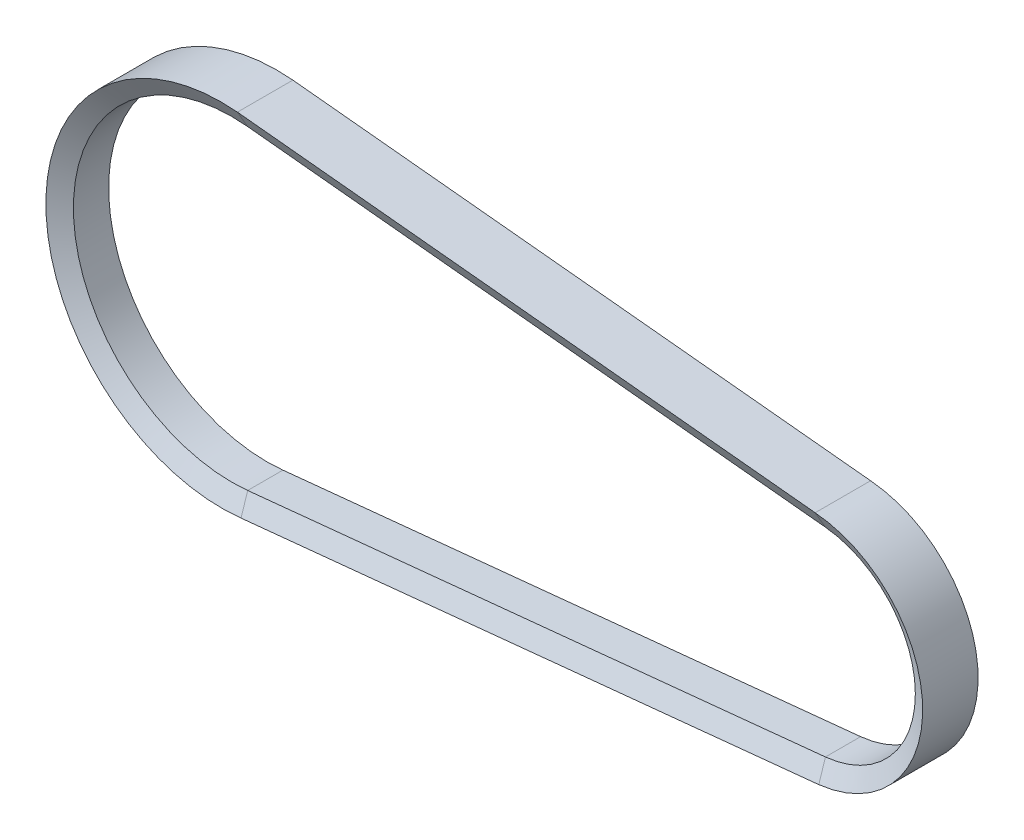
ISO-10303-21;
HEADER;
FILE_DESCRIPTION(('STEP AP214'),'2;1');
FILE_NAME('part.step','',(''),(''),'','','');
FILE_SCHEMA(('AUTOMOTIVE_DESIGN { 1 0 10303 214 1 1 1 1 }'));
ENDSEC;
DATA;
#1=APPLICATION_CONTEXT('core data for automotive mechanical design processes');
#2=APPLICATION_PROTOCOL_DEFINITION('international standard','automotive_design',2000,#1);
#3=PRODUCT_CONTEXT('',#1,'mechanical');
#4=PRODUCT('Part','Part','',(#3));
#5=PRODUCT_RELATED_PRODUCT_CATEGORY('part','',(#4));
#6=PRODUCT_DEFINITION_FORMATION('','',#4);
#7=PRODUCT_DEFINITION_CONTEXT('part definition',#1,'design');
#8=PRODUCT_DEFINITION('design','',#6,#7);
#9=PRODUCT_DEFINITION_SHAPE('','',#8);
#10=(LENGTH_UNIT() NAMED_UNIT(*) SI_UNIT(.MILLI.,.METRE.));
#11=(NAMED_UNIT(*) PLANE_ANGLE_UNIT() SI_UNIT($,.RADIAN.));
#12=(NAMED_UNIT(*) SI_UNIT($,.STERADIAN.) SOLID_ANGLE_UNIT());
#13=UNCERTAINTY_MEASURE_WITH_UNIT(LENGTH_MEASURE(1.E-05),#10,'distance_accuracy_value','');
#14=(GEOMETRIC_REPRESENTATION_CONTEXT(3) GLOBAL_UNCERTAINTY_ASSIGNED_CONTEXT((#13)) GLOBAL_UNIT_ASSIGNED_CONTEXT((#10,
#11,#12)) REPRESENTATION_CONTEXT('',''));
#15=CARTESIAN_POINT('',(0.,0.,0.));
#16=DIRECTION('',(0.,0.,1.));
#17=DIRECTION('',(1.,0.,0.));
#18=AXIS2_PLACEMENT_3D('',#15,#16,#17);
#19=CARTESIAN_POINT('',(0.,0.,0.));
#20=DIRECTION('',(0.,0.,-1.));
#21=DIRECTION('',(-1.,0.,0.));
#22=AXIS2_PLACEMENT_3D('',#19,#20,#21);
#23=CYLINDRICAL_SURFACE('',#22,54.2693283540528);
#24=CARTESIAN_POINT('',(0.,0.,5.57937029150209));
#25=DIRECTION('',(0.,0.,-1.));
#26=DIRECTION('',(0.100496256101983,-0.994937436480046,0.));
#27=AXIS2_PLACEMENT_3D('',#24,#25,#26);
#28=CIRCLE('',#27,54.2693283540528);
#29=CARTESIAN_POINT('',(5.45386432075151,-53.9945864320752,5.57937029150209));
#30=VERTEX_POINT('',#29);
#31=CARTESIAN_POINT('',(5.40000000000001,54.,5.57937029150209));
#32=VERTEX_POINT('',#31);
#33=EDGE_CURVE('E11',#30,#32,#28,.T.);
#34=ORIENTED_EDGE('',*,*,#33,.F.);
#35=DIRECTION('',(0.,0.,-1.));
#36=VECTOR('',#35,1.);
#37=CARTESIAN_POINT('',(5.4538643207515,-53.9945864320752,5.57937029150209));
#38=LINE('',#37,#36);
#39=CARTESIAN_POINT('',(5.45386432075151,-53.9945864320752,-6.49062970849791));
#40=VERTEX_POINT('',#39);
#41=EDGE_CURVE('E42',#30,#40,#38,.T.);
#42=ORIENTED_EDGE('',*,*,#41,.T.);
#43=CARTESIAN_POINT('',(0.,0.,-6.49062970849791));
#44=DIRECTION('',(0.,0.,-1.));
#45=DIRECTION('',(0.100496256101983,-0.994937436480046,0.));
#46=AXIS2_PLACEMENT_3D('',#43,#44,#45);
#47=CIRCLE('',#46,54.2693283540528);
#48=CARTESIAN_POINT('',(5.40000000000001,54.,-6.49062970849791));
#49=VERTEX_POINT('',#48);
#50=EDGE_CURVE('E125',#40,#49,#47,.T.);
#51=ORIENTED_EDGE('',*,*,#50,.T.);
#52=DIRECTION('',(0.,0.,-1.));
#53=VECTOR('',#52,1.);
#54=CARTESIAN_POINT('',(5.40000000000001,54.,5.57937029150209));
#55=LINE('',#54,#53);
#56=EDGE_CURVE('E128',#32,#49,#55,.T.);
#57=ORIENTED_EDGE('',*,*,#56,.F.);
#58=EDGE_LOOP('',(#34,#42,#51,#57));
#59=FACE_BOUND('',#58,.T.);
#60=ADVANCED_FACE('F39',(#59),#23,.F.);
#61=CARTESIAN_POINT('',(6.64784924527945,-59.8745864320751,9.04347190663988));
#62=CARTESIAN_POINT('',(-31.2778496811351,-64.0854602603342,9.04347190663988));
#63=CARTESIAN_POINT('',(-59.8420495606798,-38.7837491977207,9.04347190663988));
#64=CARTESIAN_POINT('',(-60.2392462263972,-0.627067839624251,9.04347190663988));
#65=CARTESIAN_POINT('',(-60.6364428921146,37.5296135184722,9.04347190663988));
#66=CARTESIAN_POINT('',(-32.605138259558,63.4204624433602,9.04347190663988));
#67=CARTESIAN_POINT('',(5.40000000000001,60.,9.04347190663988));
#68=CARTESIAN_POINT('',(5.4538643207515,-53.9945864320752,5.57937029150209));
#69=CARTESIAN_POINT('',(-28.7473310562264,-57.449167558059,5.57937029150209));
#70=CARTESIAN_POINT('',(-54.2521763206357,-34.4022856863446,5.57937029150209));
#71=CARTESIAN_POINT('',(-54.2693216037575,-0.027067839624249,5.57937029150209));
#72=CARTESIAN_POINT('',(-54.2864668868793,34.3481500070961,5.57937029150209));
#73=CARTESIAN_POINT('',(-28.8046244336022,57.4204624433602,5.57937029150209));
#74=CARTESIAN_POINT('',(5.40000000000001,54.,5.57937029150209));
#75=(BOUNDED_SURFACE() B_SPLINE_SURFACE(1,3,((#61,#62,#63,#64,#65,#66,#67),(#68,#69,#70,#71,#72,
#73,#74)),.UNSPECIFIED.,.F.,.F.,.F.) B_SPLINE_SURFACE_WITH_KNOTS((2,2),(4,3,4),(0.,1.),(0.,0.5,
1.),.UNSPECIFIED.) GEOMETRIC_REPRESENTATION_ITEM() RATIONAL_B_SPLINE_SURFACE(((1.,
0.780546928833291,0.780546928833291,1.,0.780546928833291,0.780546928833291,1.),(1.,
0.780546928833291,0.780546928833291,1.,0.780546928833291,0.780546928833291,1.))) REPRESENTATION_ITEM('') SURFACE());
#76=CARTESIAN_POINT('',(0.,0.,9.04347190663988));
#77=DIRECTION('',(0.,0.,-1.));
#78=DIRECTION('',(0.110351465359693,-0.993892627044274,0.));
#79=AXIS2_PLACEMENT_3D('',#76,#77,#78);
#80=CIRCLE('',#79,60.2425099078715);
#81=CARTESIAN_POINT('',(6.64784924527945,-59.8745864320752,9.04347190663988));
#82=VERTEX_POINT('',#81);
#83=CARTESIAN_POINT('',(5.40000000000001,60.,9.04347190663988));
#84=VERTEX_POINT('',#83);
#85=EDGE_CURVE('E48',#82,#84,#80,.T.);
#86=DIRECTION('',(-0.172336879396141,0.848704895708748,-0.500000000000004));
#87=VECTOR('',#86,1.);
#88=CARTESIAN_POINT('',(5.4538643207515,-53.9945864320752,5.57937029150209));
#89=LINE('',#88,#87);
#90=EDGE_CURVE('E213',#82,#30,#89,.T.);
#91=DIRECTION('',(0.,-0.866025403784436,-0.500000000000004));
#92=VECTOR('',#91,1.);
#93=CARTESIAN_POINT('',(5.40000000000001,54.,5.57937029150209));
#94=LINE('',#93,#92);
#95=EDGE_CURVE('E156',#84,#32,#94,.T.);
#96=ORIENTED_EDGE('',*,*,#85,.F.);
#97=ORIENTED_EDGE('',*,*,#90,.T.);
#98=ORIENTED_EDGE('',*,*,#33,.T.);
#99=ORIENTED_EDGE('',*,*,#95,.F.);
#100=EDGE_LOOP('',(#96,#97,#98,#99));
#101=FACE_BOUND('',#100,.T.);
#102=ADVANCED_FACE('F264',(#101),#75,.T.);
#103=CARTESIAN_POINT('',(0.,0.,0.));
#104=DIRECTION('',(0.,0.,-1.));
#105=DIRECTION('',(-1.,0.,0.));
#106=AXIS2_PLACEMENT_3D('',#103,#104,#105);
#107=CYLINDRICAL_SURFACE('',#106,60.2425099078715);
#108=CARTESIAN_POINT('',(0.,0.,-9.9547313236357));
#109=DIRECTION('',(0.,0.,-1.));
#110=DIRECTION('',(0.110351465359693,-0.993892627044274,0.));
#111=AXIS2_PLACEMENT_3D('',#108,#109,#110);
#112=CIRCLE('',#111,60.2425099078715);
#113=CARTESIAN_POINT('',(6.64784924527945,-59.8745864320752,-9.9547313236357));
#114=VERTEX_POINT('',#113);
#115=CARTESIAN_POINT('',(5.40000000000001,60.,-9.9547313236357));
#116=VERTEX_POINT('',#115);
#117=EDGE_CURVE('E135',#114,#116,#112,.T.);
#118=ORIENTED_EDGE('',*,*,#117,.F.);
#119=DIRECTION('',(0.,0.,1.));
#120=VECTOR('',#119,1.);
#121=CARTESIAN_POINT('',(6.64784924527945,-59.8745864320752,9.04347190663988));
#122=LINE('',#121,#120);
#123=EDGE_CURVE('E189',#114,#82,#122,.T.);
#124=ORIENTED_EDGE('',*,*,#123,.T.);
#125=ORIENTED_EDGE('',*,*,#85,.T.);
#126=DIRECTION('',(0.,0.,1.));
#127=VECTOR('',#126,1.);
#128=CARTESIAN_POINT('',(5.40000000000001,60.,9.04347190663988));
#129=LINE('',#128,#127);
#130=EDGE_CURVE('E162',#116,#84,#129,.T.);
#131=ORIENTED_EDGE('',*,*,#130,.F.);
#132=EDGE_LOOP('',(#118,#124,#125,#131));
#133=FACE_BOUND('',#132,.T.);
#134=ADVANCED_FACE('F260',(#133),#107,.T.);
#135=CARTESIAN_POINT('',(203.453864320752,-34.0948376899427,5.57937029150209));
#136=DIRECTION('',(-0.1,0.99498743710662,0.));
#137=DIRECTION('',(-0.99498743710662,-0.1,0.));
#138=AXIS2_PLACEMENT_3D('',#135,#136,#137);
#139=PLANE('',#138);
#140=ORIENTED_EDGE('',*,*,#41,.F.);
#141=DIRECTION('',(-0.99498743710662,-0.1,0.));
#142=VECTOR('',#141,1.);
#143=CARTESIAN_POINT('',(203.453864320752,-34.0948376899427,5.57937029150209));
#144=LINE('',#143,#142);
#145=CARTESIAN_POINT('',(203.453864320752,-34.0948376899427,5.57937029150209));
#146=VERTEX_POINT('',#145);
#147=EDGE_CURVE('E56',#146,#30,#144,.T.);
#148=ORIENTED_EDGE('',*,*,#147,.F.);
#149=DIRECTION('',(0.,0.,-1.));
#150=VECTOR('',#149,1.);
#151=CARTESIAN_POINT('',(203.453864320752,-34.0948376899427,5.57937029150209));
#152=LINE('',#151,#150);
#153=CARTESIAN_POINT('',(203.453864320752,-34.0948376899427,-6.49062970849791));
#154=VERTEX_POINT('',#153);
#155=EDGE_CURVE('E195',#146,#154,#152,.T.);
#156=ORIENTED_EDGE('',*,*,#155,.T.);
#157=DIRECTION('',(-0.99498743710662,-0.1,0.));
#158=VECTOR('',#157,1.);
#159=CARTESIAN_POINT('',(203.453864320752,-34.0948376899427,-6.49062970849791));
#160=LINE('',#159,#158);
#161=EDGE_CURVE('E192',#154,#40,#160,.T.);
#162=ORIENTED_EDGE('',*,*,#161,.T.);
#163=EDGE_LOOP('',(#140,#148,#156,#162));
#164=FACE_BOUND('',#163,.T.);
#165=ADVANCED_FACE('F239',(#164),#139,.T.);
#166=CARTESIAN_POINT('',(203.453864320752,-34.0948376899427,5.57937029150209));
#167=DIRECTION('',(-0.0501885613228501,0.499369880026909,0.864934003976172));
#168=DIRECTION('',(0.,-0.866025403784436,0.500000000000004));
#169=AXIS2_PLACEMENT_3D('',#166,#167,#168);
#170=PLANE('',#169);
#171=ORIENTED_EDGE('',*,*,#147,.T.);
#172=ORIENTED_EDGE('',*,*,#90,.F.);
#173=DIRECTION('',(-0.99498743710662,-0.1,0.));
#174=VECTOR('',#173,1.);
#175=CARTESIAN_POINT('',(204.647849245279,-39.9748376899427,9.04347190663988));
#176=LINE('',#175,#174);
#177=CARTESIAN_POINT('',(204.647849245279,-39.9748376899427,9.04347190663988));
#178=VERTEX_POINT('',#177);
#179=EDGE_CURVE('E65',#178,#82,#176,.T.);
#180=ORIENTED_EDGE('',*,*,#179,.F.);
#181=DIRECTION('',(-0.172336879396141,0.848704895708748,-0.500000000000004));
#182=VECTOR('',#181,1.);
#183=CARTESIAN_POINT('',(203.453864320752,-34.0948376899427,5.57937029150209));
#184=LINE('',#183,#182);
#185=EDGE_CURVE('E209',#178,#146,#184,.T.);
#186=ORIENTED_EDGE('',*,*,#185,.T.);
#187=EDGE_LOOP('',(#171,#172,#180,#186));
#188=FACE_BOUND('',#187,.T.);
#189=ADVANCED_FACE('F250',(#188),#170,.T.);
#190=CARTESIAN_POINT('',(204.647849245279,-39.9748376899427,9.04347190663988));
#191=DIRECTION('',(0.1,-0.99498743710662,0.));
#192=DIRECTION('',(0.99498743710662,0.1,0.));
#193=AXIS2_PLACEMENT_3D('',#190,#191,#192);
#194=PLANE('',#193);
#195=ORIENTED_EDGE('',*,*,#179,.T.);
#196=ORIENTED_EDGE('',*,*,#123,.F.);
#197=DIRECTION('',(-0.99498743710662,-0.1,0.));
#198=VECTOR('',#197,1.);
#199=CARTESIAN_POINT('',(204.647849245279,-39.9748376899427,-9.9547313236357));
#200=LINE('',#199,#198);
#201=CARTESIAN_POINT('',(204.647849245279,-39.9748376899427,-9.9547313236357));
#202=VERTEX_POINT('',#201);
#203=EDGE_CURVE('E93',#202,#114,#200,.T.);
#204=ORIENTED_EDGE('',*,*,#203,.F.);
#205=DIRECTION('',(0.,0.,1.));
#206=VECTOR('',#205,1.);
#207=CARTESIAN_POINT('',(204.647849245279,-39.9748376899427,9.04347190663988));
#208=LINE('',#207,#206);
#209=EDGE_CURVE('E181',#202,#178,#208,.T.);
#210=ORIENTED_EDGE('',*,*,#209,.T.);
#211=EDGE_LOOP('',(#195,#196,#204,#210));
#212=FACE_BOUND('',#211,.T.);
#213=ADVANCED_FACE('F252',(#212),#194,.T.);
#214=CARTESIAN_POINT('',(204.647849245279,-39.9748376899427,-9.9547313236357));
#215=DIRECTION('',(-0.05018856132285,0.499369880026909,-0.864934003976172));
#216=DIRECTION('',(0.,0.866025403784436,0.500000000000004));
#217=AXIS2_PLACEMENT_3D('',#214,#215,#216);
#218=PLANE('',#217);
#219=ORIENTED_EDGE('',*,*,#203,.T.);
#220=DIRECTION('',(0.172336879396141,-0.848704895708748,-0.500000000000004));
#221=VECTOR('',#220,1.);
#222=CARTESIAN_POINT('',(6.64784924527945,-59.8745864320752,-9.9547313236357));
#223=LINE('',#222,#221);
#224=EDGE_CURVE('E186',#40,#114,#223,.T.);
#225=ORIENTED_EDGE('',*,*,#224,.F.);
#226=ORIENTED_EDGE('',*,*,#161,.F.);
#227=DIRECTION('',(0.172336879396141,-0.848704895708748,-0.500000000000004));
#228=VECTOR('',#227,1.);
#229=CARTESIAN_POINT('',(204.647849245279,-39.9748376899427,-9.9547313236357));
#230=LINE('',#229,#228);
#231=EDGE_CURVE('E174',#154,#202,#230,.T.);
#232=ORIENTED_EDGE('',*,*,#231,.T.);
#233=EDGE_LOOP('',(#219,#225,#226,#232));
#234=FACE_BOUND('',#233,.T.);
#235=ADVANCED_FACE('F258',(#234),#218,.T.);
#236=CARTESIAN_POINT('',(200.,0.,0.));
#237=DIRECTION('',(0.,0.,-1.));
#238=DIRECTION('',(-1.,0.,0.));
#239=AXIS2_PLACEMENT_3D('',#236,#237,#238);
#240=CYLINDRICAL_SURFACE('',#239,34.2693322936076);
#241=ORIENTED_EDGE('',*,*,#155,.F.);
#242=CARTESIAN_POINT('',(200.,0.,5.57937029150209));
#243=DIRECTION('',(0.,0.,-1.));
#244=DIRECTION('',(0.0992140719541894,0.995066112339411,0.));
#245=AXIS2_PLACEMENT_3D('',#242,#243,#244);
#246=CIRCLE('',#245,34.2693322936076);
#247=CARTESIAN_POINT('',(203.4,34.1002512578676,5.57937029150209));
#248=VERTEX_POINT('',#247);
#249=EDGE_CURVE('E226',#248,#146,#246,.T.);
#250=ORIENTED_EDGE('',*,*,#249,.F.);
#251=DIRECTION('',(0.,0.,-1.));
#252=VECTOR('',#251,1.);
#253=CARTESIAN_POINT('',(203.4,34.1002512578676,5.57937029150209));
#254=LINE('',#253,#252);
#255=CARTESIAN_POINT('',(203.4,34.1002512578676,-6.49062970849791));
#256=VERTEX_POINT('',#255);
#257=EDGE_CURVE('E185',#248,#256,#254,.T.);
#258=ORIENTED_EDGE('',*,*,#257,.T.);
#259=CARTESIAN_POINT('',(200.,0.,-6.49062970849791));
#260=DIRECTION('',(0.,0.,-1.));
#261=DIRECTION('',(0.0992140719541894,0.995066112339411,0.));
#262=AXIS2_PLACEMENT_3D('',#259,#260,#261);
#263=CIRCLE('',#262,34.2693322936076);
#264=EDGE_CURVE('E178',#256,#154,#263,.T.);
#265=ORIENTED_EDGE('',*,*,#264,.T.);
#266=EDGE_LOOP('',(#241,#250,#258,#265));
#267=FACE_BOUND('',#266,.T.);
#268=ADVANCED_FACE('F244',(#267),#240,.F.);
#269=CARTESIAN_POINT('',(203.4,40.1002512578676,9.04347190663988));
#270=CARTESIAN_POINT('',(269.898743710662,34.4619891142634,9.04347190663988));
#271=CARTESIAN_POINT('',(270.938618081728,-32.2672516755784,9.04347190663988));
#272=CARTESIAN_POINT('',(204.647849245279,-39.9748376899427,9.04347190663988));
#273=CARTESIAN_POINT('',(203.4,34.1002512578676,5.57937029150209));
#274=CARTESIAN_POINT('',(259.948869339596,28.4619891142634,5.57937029150209));
#275=CARTESIAN_POINT('',(259.993756273555,-28.3672516755785,5.57937029150209));
#276=CARTESIAN_POINT('',(203.453864320752,-34.0948376899427,5.57937029150209));
#277=(BOUNDED_SURFACE() B_SPLINE_SURFACE(1,3,((#269,#270,#271,#272),(#273,#274,#275,#276)),
.UNSPECIFIED.,.F.,.F.,.F.) B_SPLINE_SURFACE_WITH_KNOTS((2,2),(4,4),(0.,1.),(0.,1.),
.UNSPECIFIED.) GEOMETRIC_REPRESENTATION_ITEM() RATIONAL_B_SPLINE_SURFACE(((1.,0.4,0.4,1.),(1.,
0.4,0.4,1.))) REPRESENTATION_ITEM('') SURFACE());
#278=CARTESIAN_POINT('',(200.,0.,9.04347190663988));
#279=DIRECTION('',(0.,0.,-1.));
#280=DIRECTION('',(0.0844843668130414,0.996424804871998,0.));
#281=AXIS2_PLACEMENT_3D('',#278,#279,#280);
#282=CIRCLE('',#281,40.2441318821031);
#283=CARTESIAN_POINT('',(203.4,40.1002512578676,9.04347190663988));
#284=VERTEX_POINT('',#283);
#285=EDGE_CURVE('E106',#284,#178,#282,.T.);
#286=DIRECTION('',(0.,-0.866025403784436,-0.500000000000004));
#287=VECTOR('',#286,1.);
#288=CARTESIAN_POINT('',(203.4,34.1002512578676,5.57937029150209));
#289=LINE('',#288,#287);
#290=EDGE_CURVE('E204',#284,#248,#289,.T.);
#291=ORIENTED_EDGE('',*,*,#249,.T.);
#292=ORIENTED_EDGE('',*,*,#185,.F.);
#293=ORIENTED_EDGE('',*,*,#285,.F.);
#294=ORIENTED_EDGE('',*,*,#290,.T.);
#295=EDGE_LOOP('',(#291,#292,#293,#294));
#296=FACE_BOUND('',#295,.T.);
#297=ADVANCED_FACE('F249',(#296),#277,.T.);
#298=CARTESIAN_POINT('',(200.,0.,0.));
#299=DIRECTION('',(0.,0.,-1.));
#300=DIRECTION('',(-1.,0.,0.));
#301=AXIS2_PLACEMENT_3D('',#298,#299,#300);
#302=CYLINDRICAL_SURFACE('',#301,40.2441318821031);
#303=ORIENTED_EDGE('',*,*,#285,.T.);
#304=ORIENTED_EDGE('',*,*,#209,.F.);
#305=CARTESIAN_POINT('',(200.,0.,-9.9547313236357));
#306=DIRECTION('',(0.,0.,-1.));
#307=DIRECTION('',(0.0844843668130414,0.996424804871998,0.));
#308=AXIS2_PLACEMENT_3D('',#305,#306,#307);
#309=CIRCLE('',#308,40.2441318821031);
#310=CARTESIAN_POINT('',(203.4,40.1002512578676,-9.9547313236357));
#311=VERTEX_POINT('',#310);
#312=EDGE_CURVE('E112',#311,#202,#309,.T.);
#313=ORIENTED_EDGE('',*,*,#312,.F.);
#314=DIRECTION('',(0.,0.,1.));
#315=VECTOR('',#314,1.);
#316=CARTESIAN_POINT('',(203.4,40.1002512578676,9.04347190663988));
#317=LINE('',#316,#315);
#318=EDGE_CURVE('E172',#311,#284,#317,.T.);
#319=ORIENTED_EDGE('',*,*,#318,.T.);
#320=EDGE_LOOP('',(#303,#304,#313,#319));
#321=FACE_BOUND('',#320,.T.);
#322=ADVANCED_FACE('F289',(#321),#302,.T.);
#323=CARTESIAN_POINT('',(203.4,34.1002512578676,-6.49062970849791));
#324=CARTESIAN_POINT('',(259.948869339596,28.4619891142634,-6.49062970849791));
#325=CARTESIAN_POINT('',(259.993756273555,-28.3672516755785,-6.49062970849791));
#326=CARTESIAN_POINT('',(203.453864320752,-34.0948376899427,-6.49062970849791));
#327=CARTESIAN_POINT('',(203.4,40.1002512578676,-9.9547313236357));
#328=CARTESIAN_POINT('',(269.898743710662,34.4619891142634,-9.9547313236357));
#329=CARTESIAN_POINT('',(270.938618081728,-32.2672516755784,-9.9547313236357));
#330=CARTESIAN_POINT('',(204.647849245279,-39.9748376899427,-9.9547313236357));
#331=(BOUNDED_SURFACE() B_SPLINE_SURFACE(1,3,((#323,#324,#325,#326),(#327,#328,#329,#330)),
.UNSPECIFIED.,.F.,.F.,.F.) B_SPLINE_SURFACE_WITH_KNOTS((2,2),(4,4),(0.,1.),(0.,1.),
.UNSPECIFIED.) GEOMETRIC_REPRESENTATION_ITEM() RATIONAL_B_SPLINE_SURFACE(((1.,0.4,0.4,1.),(1.,
0.4,0.4,1.))) REPRESENTATION_ITEM('') SURFACE());
#332=DIRECTION('',(0.,0.866025403784436,-0.500000000000004));
#333=VECTOR('',#332,1.);
#334=CARTESIAN_POINT('',(203.4,40.1002512578676,-9.9547313236357));
#335=LINE('',#334,#333);
#336=EDGE_CURVE('E146',#256,#311,#335,.T.);
#337=ORIENTED_EDGE('',*,*,#312,.T.);
#338=ORIENTED_EDGE('',*,*,#231,.F.);
#339=ORIENTED_EDGE('',*,*,#264,.F.);
#340=ORIENTED_EDGE('',*,*,#336,.T.);
#341=EDGE_LOOP('',(#337,#338,#339,#340));
#342=FACE_BOUND('',#341,.T.);
#343=ADVANCED_FACE('F242',(#342),#331,.T.);
#344=CARTESIAN_POINT('',(5.40000000000001,54.,5.57937029150209));
#345=DIRECTION('',(-0.1,-0.99498743710662,0.));
#346=DIRECTION('',(0.99498743710662,-0.1,0.));
#347=AXIS2_PLACEMENT_3D('',#344,#345,#346);
#348=PLANE('',#347);
#349=ORIENTED_EDGE('',*,*,#257,.F.);
#350=DIRECTION('',(0.99498743710662,-0.1,0.));
#351=VECTOR('',#350,1.);
#352=CARTESIAN_POINT('',(5.40000000000001,54.,5.57937029150209));
#353=LINE('',#352,#351);
#354=EDGE_CURVE('E154',#32,#248,#353,.T.);
#355=ORIENTED_EDGE('',*,*,#354,.F.);
#356=ORIENTED_EDGE('',*,*,#56,.T.);
#357=DIRECTION('',(0.99498743710662,-0.1,0.));
#358=VECTOR('',#357,1.);
#359=CARTESIAN_POINT('',(5.40000000000001,54.,-6.49062970849791));
#360=LINE('',#359,#358);
#361=EDGE_CURVE('E141',#49,#256,#360,.T.);
#362=ORIENTED_EDGE('',*,*,#361,.T.);
#363=EDGE_LOOP('',(#349,#355,#356,#362));
#364=FACE_BOUND('',#363,.T.);
#365=ADVANCED_FACE('F152',(#364),#348,.T.);
#366=CARTESIAN_POINT('',(5.40000000000001,54.,5.57937029150209));
#367=DIRECTION('',(-0.0501885613228501,-0.499369880026909,0.864934003976172));
#368=DIRECTION('',(0.,-0.866025403784436,-0.500000000000004));
#369=AXIS2_PLACEMENT_3D('',#366,#367,#368);
#370=PLANE('',#369);
#371=ORIENTED_EDGE('',*,*,#354,.T.);
#372=ORIENTED_EDGE('',*,*,#290,.F.);
#373=DIRECTION('',(0.99498743710662,-0.1,0.));
#374=VECTOR('',#373,1.);
#375=CARTESIAN_POINT('',(5.40000000000001,60.,9.04347190663988));
#376=LINE('',#375,#374);
#377=EDGE_CURVE('E200',#84,#284,#376,.T.);
#378=ORIENTED_EDGE('',*,*,#377,.F.);
#379=ORIENTED_EDGE('',*,*,#95,.T.);
#380=EDGE_LOOP('',(#371,#372,#378,#379));
#381=FACE_BOUND('',#380,.T.);
#382=ADVANCED_FACE('F246',(#381),#370,.T.);
#383=CARTESIAN_POINT('',(5.40000000000001,60.,9.04347190663988));
#384=DIRECTION('',(0.1,0.99498743710662,0.));
#385=DIRECTION('',(-0.99498743710662,0.1,0.));
#386=AXIS2_PLACEMENT_3D('',#383,#384,#385);
#387=PLANE('',#386);
#388=ORIENTED_EDGE('',*,*,#377,.T.);
#389=ORIENTED_EDGE('',*,*,#318,.F.);
#390=DIRECTION('',(0.99498743710662,-0.1,0.));
#391=VECTOR('',#390,1.);
#392=CARTESIAN_POINT('',(5.40000000000001,60.,-9.9547313236357));
#393=LINE('',#392,#391);
#394=EDGE_CURVE('E170',#116,#311,#393,.T.);
#395=ORIENTED_EDGE('',*,*,#394,.F.);
#396=ORIENTED_EDGE('',*,*,#130,.T.);
#397=EDGE_LOOP('',(#388,#389,#395,#396));
#398=FACE_BOUND('',#397,.T.);
#399=ADVANCED_FACE('F302',(#398),#387,.T.);
#400=CARTESIAN_POINT('',(5.40000000000001,60.,-9.9547313236357));
#401=DIRECTION('',(-0.05018856132285,-0.499369880026909,-0.864934003976172));
#402=DIRECTION('',(0.,0.866025403784437,-0.500000000000004));
#403=AXIS2_PLACEMENT_3D('',#400,#401,#402);
#404=PLANE('',#403);
#405=ORIENTED_EDGE('',*,*,#394,.T.);
#406=ORIENTED_EDGE('',*,*,#336,.F.);
#407=ORIENTED_EDGE('',*,*,#361,.F.);
#408=DIRECTION('',(0.,0.866025403784436,-0.500000000000004));
#409=VECTOR('',#408,1.);
#410=CARTESIAN_POINT('',(5.40000000000001,60.,-9.9547313236357));
#411=LINE('',#410,#409);
#412=EDGE_CURVE('E144',#49,#116,#411,.T.);
#413=ORIENTED_EDGE('',*,*,#412,.T.);
#414=EDGE_LOOP('',(#405,#406,#407,#413));
#415=FACE_BOUND('',#414,.T.);
#416=ADVANCED_FACE('F143',(#415),#404,.T.);
#417=CARTESIAN_POINT('',(5.4538643207515,-53.9945864320752,-6.49062970849791));
#418=CARTESIAN_POINT('',(-28.7473310562264,-57.449167558059,-6.49062970849791));
#419=CARTESIAN_POINT('',(-54.2521763206357,-34.4022856863446,-6.49062970849791));
#420=CARTESIAN_POINT('',(-54.2693216037575,-0.027067839624249,-6.49062970849791));
#421=CARTESIAN_POINT('',(-54.2864668868793,34.3481500070961,-6.49062970849791));
#422=CARTESIAN_POINT('',(-28.8046244336022,57.4204624433602,-6.49062970849791));
#423=CARTESIAN_POINT('',(5.40000000000001,54.,-6.49062970849791));
#424=CARTESIAN_POINT('',(6.64784924527945,-59.8745864320751,-9.9547313236357));
#425=CARTESIAN_POINT('',(-31.2778496811351,-64.0854602603342,-9.9547313236357));
#426=CARTESIAN_POINT('',(-59.8420495606798,-38.7837491977207,-9.9547313236357));
#427=CARTESIAN_POINT('',(-60.2392462263972,-0.627067839624251,-9.9547313236357));
#428=CARTESIAN_POINT('',(-60.6364428921146,37.5296135184722,-9.9547313236357));
#429=CARTESIAN_POINT('',(-32.605138259558,63.4204624433602,-9.9547313236357));
#430=CARTESIAN_POINT('',(5.40000000000001,60.,-9.9547313236357));
#431=(BOUNDED_SURFACE() B_SPLINE_SURFACE(1,3,((#417,#418,#419,#420,#421,#422,#423),(#424,#425,
#426,#427,#428,#429,#430)),.UNSPECIFIED.,.F.,.F.,.F.) B_SPLINE_SURFACE_WITH_KNOTS((2,2),(4,3,4),
(0.,1.),(0.,0.5,1.),
.UNSPECIFIED.) GEOMETRIC_REPRESENTATION_ITEM() RATIONAL_B_SPLINE_SURFACE(((1.,0.780546928833291,
0.780546928833291,1.,0.780546928833291,0.780546928833291,1.),(1.,0.780546928833291,
0.780546928833291,1.,0.780546928833291,0.780546928833291,1.))) REPRESENTATION_ITEM('') SURFACE());
#432=ORIENTED_EDGE('',*,*,#224,.T.);
#433=ORIENTED_EDGE('',*,*,#117,.T.);
#434=ORIENTED_EDGE('',*,*,#412,.F.);
#435=ORIENTED_EDGE('',*,*,#50,.F.);
#436=EDGE_LOOP('',(#432,#433,#434,#435));
#437=FACE_BOUND('',#436,.T.);
#438=ADVANCED_FACE('F158',(#437),#431,.T.);
#439=CLOSED_SHELL('',(#60,#102,#134,#165,#189,#213,#235,#268,#297,#322,#343,#365,#382,#399,#416,#438));
#440=MANIFOLD_SOLID_BREP('B2',#439);
#441=ADVANCED_BREP_SHAPE_REPRESENTATION('',(#18,#440),#14);
#442=SHAPE_DEFINITION_REPRESENTATION(#9,#441);
ENDSEC;
END-ISO-10303-21;
